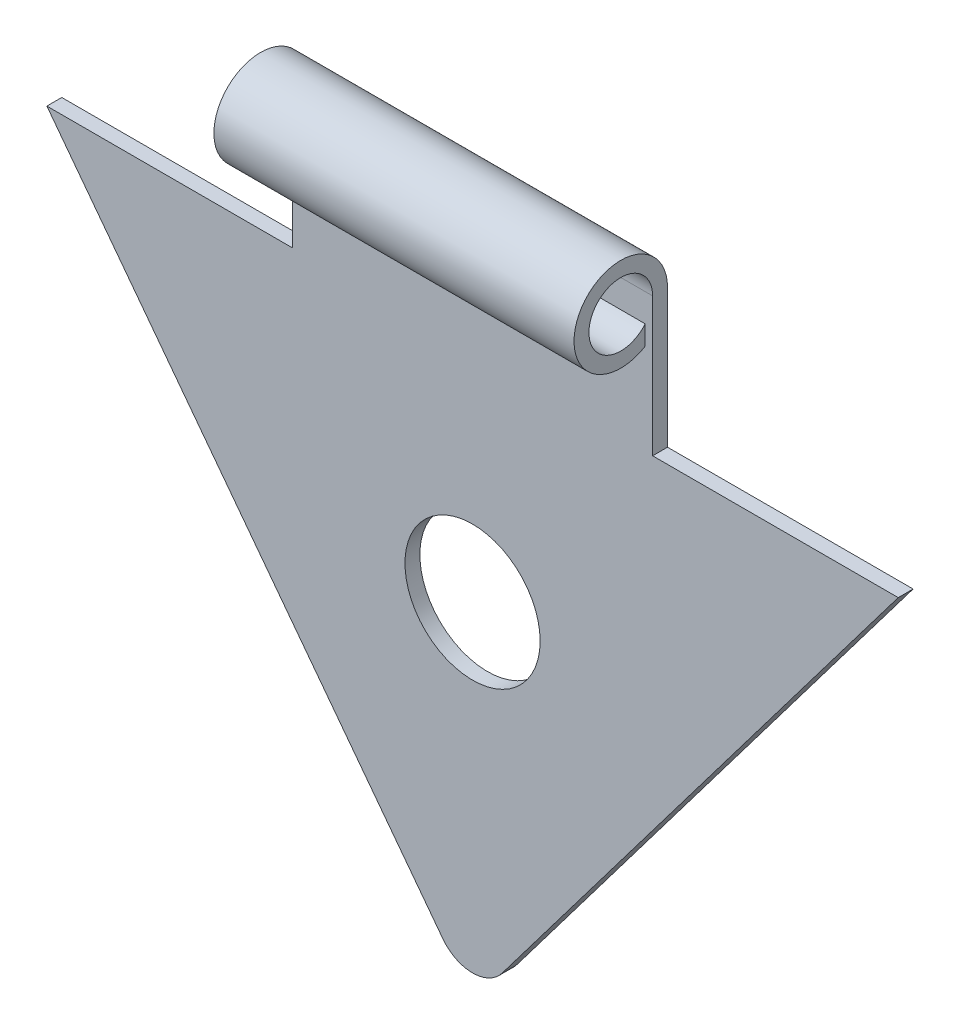
ISO-10303-21;
HEADER;
FILE_DESCRIPTION(('STEP AP214'),'2;1');
FILE_NAME('part.step','',(''),(''),'','','');
FILE_SCHEMA(('AUTOMOTIVE_DESIGN { 1 0 10303 214 1 1 1 1 }'));
ENDSEC;
DATA;
#1=APPLICATION_CONTEXT('core data for automotive mechanical design processes');
#2=APPLICATION_PROTOCOL_DEFINITION('international standard','automotive_design',2000,#1);
#3=PRODUCT_CONTEXT('',#1,'mechanical');
#4=PRODUCT('Part','Part','',(#3));
#5=PRODUCT_RELATED_PRODUCT_CATEGORY('part','',(#4));
#6=PRODUCT_DEFINITION_FORMATION('','',#4);
#7=PRODUCT_DEFINITION_CONTEXT('part definition',#1,'design');
#8=PRODUCT_DEFINITION('design','',#6,#7);
#9=PRODUCT_DEFINITION_SHAPE('','',#8);
#10=(LENGTH_UNIT() NAMED_UNIT(*) SI_UNIT(.MILLI.,.METRE.));
#11=(NAMED_UNIT(*) PLANE_ANGLE_UNIT() SI_UNIT($,.RADIAN.));
#12=(NAMED_UNIT(*) SI_UNIT($,.STERADIAN.) SOLID_ANGLE_UNIT());
#13=UNCERTAINTY_MEASURE_WITH_UNIT(LENGTH_MEASURE(1.E-05),#10,'distance_accuracy_value','');
#14=(GEOMETRIC_REPRESENTATION_CONTEXT(3) GLOBAL_UNCERTAINTY_ASSIGNED_CONTEXT((#13)) GLOBAL_UNIT_ASSIGNED_CONTEXT((#10,
#11,#12)) REPRESENTATION_CONTEXT('',''));
#15=CARTESIAN_POINT('',(0.,0.,0.));
#16=DIRECTION('',(0.,0.,1.));
#17=DIRECTION('',(1.,0.,0.));
#18=AXIS2_PLACEMENT_3D('',#15,#16,#17);
#19=CARTESIAN_POINT('',(-11.43,0.,0.4));
#20=DIRECTION('',(0.,-1.,0.));
#21=DIRECTION('',(0.,0.,-1.));
#22=AXIS2_PLACEMENT_3D('',#19,#20,#21);
#23=PLANE('',#22);
#24=DIRECTION('',(0.,0.,-1.));
#25=VECTOR('',#24,1.);
#26=CARTESIAN_POINT('',(4.835,0.,0.4));
#27=LINE('',#26,#25);
#28=CARTESIAN_POINT('',(4.835,0.,0.4));
#29=VERTEX_POINT('',#28);
#30=CARTESIAN_POINT('',(4.835,0.,0.));
#31=VERTEX_POINT('',#30);
#32=EDGE_CURVE('E135',#29,#31,#27,.T.);
#33=ORIENTED_EDGE('',*,*,#32,.F.);
#34=DIRECTION('',(-1.,0.,0.));
#35=VECTOR('',#34,1.);
#36=CARTESIAN_POINT('',(-11.43,0.,0.4));
#37=LINE('',#36,#35);
#38=CARTESIAN_POINT('',(11.43,0.,0.4));
#39=VERTEX_POINT('',#38);
#40=EDGE_CURVE('E96',#39,#29,#37,.T.);
#41=ORIENTED_EDGE('',*,*,#40,.F.);
#42=DIRECTION('',(0.,0.,-1.));
#43=VECTOR('',#42,1.);
#44=CARTESIAN_POINT('',(11.43,0.,0.4));
#45=LINE('',#44,#43);
#46=CARTESIAN_POINT('',(11.43,0.,0.));
#47=VERTEX_POINT('',#46);
#48=EDGE_CURVE('E11',#39,#47,#45,.T.);
#49=ORIENTED_EDGE('',*,*,#48,.T.);
#50=DIRECTION('',(-1.,0.,0.));
#51=VECTOR('',#50,1.);
#52=CARTESIAN_POINT('',(-11.43,0.,0.));
#53=LINE('',#52,#51);
#54=EDGE_CURVE('E143',#47,#31,#53,.T.);
#55=ORIENTED_EDGE('',*,*,#54,.T.);
#56=EDGE_LOOP('',(#33,#41,#49,#55));
#57=FACE_BOUND('',#56,.T.);
#58=ADVANCED_FACE('F43',(#57),#23,.F.);
#59=CARTESIAN_POINT('',(0.,-13.4431158100442,0.4));
#60=DIRECTION('',(0.,0.,1.));
#61=DIRECTION('',(1.,0.,0.));
#62=AXIS2_PLACEMENT_3D('',#59,#60,#61);
#63=PLANE('',#62);
#64=DIRECTION('',(0.603542484177288,0.797330840864134,0.));
#65=VECTOR('',#64,1.);
#66=CARTESIAN_POINT('',(0.797330840864142,-14.0466582942215,0.4));
#67=LINE('',#66,#65);
#68=CARTESIAN_POINT('',(0.797330840864142,-14.0466582942215,0.4));
#69=VERTEX_POINT('',#68);
#70=EDGE_CURVE('E150',#69,#39,#67,.T.);
#71=ORIENTED_EDGE('',*,*,#70,.T.);
#72=ORIENTED_EDGE('',*,*,#40,.T.);
#73=DIRECTION('',(0.,-1.,0.));
#74=VECTOR('',#73,1.);
#75=CARTESIAN_POINT('',(4.835,3.71869472622847,0.400000000000001));
#76=LINE('',#75,#74);
#77=CARTESIAN_POINT('',(4.835,3.71869472622847,0.400000000000001));
#78=VERTEX_POINT('',#77);
#79=EDGE_CURVE('E132',#78,#29,#76,.T.);
#80=ORIENTED_EDGE('',*,*,#79,.F.);
#81=DIRECTION('',(1.,0.,0.));
#82=VECTOR('',#81,1.);
#83=CARTESIAN_POINT('',(-4.835,3.71869472622847,0.400000000000001));
#84=LINE('',#83,#82);
#85=CARTESIAN_POINT('',(-4.835,3.71869472622847,0.400000000000001));
#86=VERTEX_POINT('',#85);
#87=EDGE_CURVE('E225',#86,#78,#84,.T.);
#88=ORIENTED_EDGE('',*,*,#87,.F.);
#89=DIRECTION('',(0.,-1.,0.));
#90=VECTOR('',#89,1.);
#91=CARTESIAN_POINT('',(-4.835,3.71869472622847,0.400000000000001));
#92=LINE('',#91,#90);
#93=CARTESIAN_POINT('',(-4.835,0.,0.4));
#94=VERTEX_POINT('',#93);
#95=EDGE_CURVE('E224',#86,#94,#92,.T.);
#96=ORIENTED_EDGE('',*,*,#95,.T.);
#97=CARTESIAN_POINT('',(-11.43,0.,0.4));
#98=VERTEX_POINT('',#97);
#99=EDGE_CURVE('E154',#94,#98,#37,.T.);
#100=ORIENTED_EDGE('',*,*,#99,.T.);
#101=DIRECTION('',(0.603542484177288,-0.797330840864134,0.));
#102=VECTOR('',#101,1.);
#103=CARTESIAN_POINT('',(-11.43,0.,0.4));
#104=LINE('',#103,#102);
#105=CARTESIAN_POINT('',(-0.797330840864138,-14.0466582942215,0.4));
#106=VERTEX_POINT('',#105);
#107=EDGE_CURVE('E153',#98,#106,#104,.T.);
#108=ORIENTED_EDGE('',*,*,#107,.T.);
#109=CARTESIAN_POINT('',(0.,-13.4431158100442,0.4));
#110=DIRECTION('',(0.,0.,1.));
#111=DIRECTION('',(1.,0.,0.));
#112=AXIS2_PLACEMENT_3D('',#109,#110,#111);
#113=CIRCLE('',#112,1.);
#114=EDGE_CURVE('E68',#106,#69,#113,.T.);
#115=ORIENTED_EDGE('',*,*,#114,.T.);
#116=EDGE_LOOP('',(#71,#72,#80,#88,#96,#100,#108,#115));
#117=FACE_BOUND('',#116,.T.);
#118=CARTESIAN_POINT('',(0.,-5.82,0.4));
#119=DIRECTION('',(0.,0.,1.));
#120=DIRECTION('',(1.,0.,0.));
#121=AXIS2_PLACEMENT_3D('',#118,#119,#120);
#122=CIRCLE('',#121,1.815);
#123=CARTESIAN_POINT('',(1.815,-5.82,0.4));
#124=VERTEX_POINT('',#123);
#125=EDGE_CURVE('E170',#124,#124,#122,.T.);
#126=ORIENTED_EDGE('',*,*,#125,.F.);
#127=EDGE_LOOP('',(#126));
#128=FACE_BOUND('',#127,.T.);
#129=ADVANCED_FACE('F147',(#117,#128),#63,.T.);
#130=CARTESIAN_POINT('',(0.,-13.4431158100442,0.));
#131=DIRECTION('',(0.,0.,1.));
#132=DIRECTION('',(1.,0.,0.));
#133=AXIS2_PLACEMENT_3D('',#130,#131,#132);
#134=PLANE('',#133);
#135=DIRECTION('',(0.603542484177288,0.797330840864134,0.));
#136=VECTOR('',#135,1.);
#137=CARTESIAN_POINT('',(0.797330840864142,-14.0466582942215,0.));
#138=LINE('',#137,#136);
#139=CARTESIAN_POINT('',(0.797330840864142,-14.0466582942215,0.));
#140=VERTEX_POINT('',#139);
#141=EDGE_CURVE('E165',#140,#47,#138,.T.);
#142=ORIENTED_EDGE('',*,*,#141,.F.);
#143=CARTESIAN_POINT('',(0.,-13.4431158100442,0.));
#144=DIRECTION('',(0.,0.,1.));
#145=DIRECTION('',(1.,0.,0.));
#146=AXIS2_PLACEMENT_3D('',#143,#144,#145);
#147=CIRCLE('',#146,1.);
#148=CARTESIAN_POINT('',(-0.797330840864138,-14.0466582942215,0.));
#149=VERTEX_POINT('',#148);
#150=EDGE_CURVE('E89',#149,#140,#147,.T.);
#151=ORIENTED_EDGE('',*,*,#150,.F.);
#152=DIRECTION('',(0.603542484177288,-0.797330840864134,0.));
#153=VECTOR('',#152,1.);
#154=CARTESIAN_POINT('',(-11.43,0.,0.));
#155=LINE('',#154,#153);
#156=CARTESIAN_POINT('',(-11.43,0.,0.));
#157=VERTEX_POINT('',#156);
#158=EDGE_CURVE('E173',#157,#149,#155,.T.);
#159=ORIENTED_EDGE('',*,*,#158,.F.);
#160=CARTESIAN_POINT('',(-4.835,0.,0.));
#161=VERTEX_POINT('',#160);
#162=EDGE_CURVE('E169',#161,#157,#53,.T.);
#163=ORIENTED_EDGE('',*,*,#162,.F.);
#164=DIRECTION('',(0.,1.,0.));
#165=VECTOR('',#164,1.);
#166=CARTESIAN_POINT('',(-4.835,3.71869472622847,0.));
#167=LINE('',#166,#165);
#168=CARTESIAN_POINT('',(-4.835,3.71869472622847,0.));
#169=VERTEX_POINT('',#168);
#170=EDGE_CURVE('E59',#161,#169,#167,.T.);
#171=ORIENTED_EDGE('',*,*,#170,.T.);
#172=DIRECTION('',(1.,0.,0.));
#173=VECTOR('',#172,1.);
#174=CARTESIAN_POINT('',(-4.835,3.71869472622847,0.));
#175=LINE('',#174,#173);
#176=CARTESIAN_POINT('',(4.835,3.71869472622847,0.));
#177=VERTEX_POINT('',#176);
#178=EDGE_CURVE('E250',#169,#177,#175,.T.);
#179=ORIENTED_EDGE('',*,*,#178,.T.);
#180=DIRECTION('',(0.,1.,0.));
#181=VECTOR('',#180,1.);
#182=CARTESIAN_POINT('',(4.835,3.71869472622847,0.));
#183=LINE('',#182,#181);
#184=EDGE_CURVE('E145',#31,#177,#183,.T.);
#185=ORIENTED_EDGE('',*,*,#184,.F.);
#186=ORIENTED_EDGE('',*,*,#54,.F.);
#187=EDGE_LOOP('',(#142,#151,#159,#163,#171,#179,#185,#186));
#188=FACE_BOUND('',#187,.T.);
#189=CARTESIAN_POINT('',(0.,-5.82,0.));
#190=DIRECTION('',(0.,0.,1.));
#191=DIRECTION('',(1.,0.,0.));
#192=AXIS2_PLACEMENT_3D('',#189,#190,#191);
#193=CIRCLE('',#192,1.815);
#194=CARTESIAN_POINT('',(1.815,-5.82,0.));
#195=VERTEX_POINT('',#194);
#196=EDGE_CURVE('E253',#195,#195,#193,.T.);
#197=ORIENTED_EDGE('',*,*,#196,.T.);
#198=EDGE_LOOP('',(#197));
#199=FACE_BOUND('',#198,.T.);
#200=ADVANCED_FACE('F195',(#188,#199),#134,.F.);
#201=CARTESIAN_POINT('',(0.797330840864142,-14.0466582942215,0.4));
#202=DIRECTION('',(-0.797330840864134,0.603542484177288,0.));
#203=DIRECTION('',(-0.603542484177288,-0.797330840864134,0.));
#204=AXIS2_PLACEMENT_3D('',#201,#202,#203);
#205=PLANE('',#204);
#206=ORIENTED_EDGE('',*,*,#141,.T.);
#207=ORIENTED_EDGE('',*,*,#48,.F.);
#208=ORIENTED_EDGE('',*,*,#70,.F.);
#209=DIRECTION('',(0.,0.,-1.));
#210=VECTOR('',#209,1.);
#211=CARTESIAN_POINT('',(0.797330840864142,-14.0466582942215,0.4));
#212=LINE('',#211,#210);
#213=EDGE_CURVE('E164',#69,#140,#212,.T.);
#214=ORIENTED_EDGE('',*,*,#213,.T.);
#215=EDGE_LOOP('',(#206,#207,#208,#214));
#216=FACE_BOUND('',#215,.T.);
#217=ADVANCED_FACE('F45',(#216),#205,.F.);
#218=ORIENTED_EDGE('',*,*,#99,.F.);
#219=DIRECTION('',(0.,0.,-1.));
#220=VECTOR('',#219,1.);
#221=CARTESIAN_POINT('',(-4.835,0.,0.4));
#222=LINE('',#221,#220);
#223=EDGE_CURVE('E221',#94,#161,#222,.T.);
#224=ORIENTED_EDGE('',*,*,#223,.T.);
#225=ORIENTED_EDGE('',*,*,#162,.T.);
#226=DIRECTION('',(0.,0.,-1.));
#227=VECTOR('',#226,1.);
#228=CARTESIAN_POINT('',(-11.43,0.,0.4));
#229=LINE('',#228,#227);
#230=EDGE_CURVE('E52',#98,#157,#229,.T.);
#231=ORIENTED_EDGE('',*,*,#230,.F.);
#232=EDGE_LOOP('',(#218,#224,#225,#231));
#233=FACE_BOUND('',#232,.T.);
#234=ADVANCED_FACE('F209',(#233),#23,.F.);
#235=CARTESIAN_POINT('',(-11.43,0.,0.4));
#236=DIRECTION('',(0.797330840864134,0.603542484177288,0.));
#237=DIRECTION('',(-0.603542484177289,0.797330840864135,0.));
#238=AXIS2_PLACEMENT_3D('',#235,#236,#237);
#239=PLANE('',#238);
#240=ORIENTED_EDGE('',*,*,#158,.T.);
#241=DIRECTION('',(0.,0.,-1.));
#242=VECTOR('',#241,1.);
#243=CARTESIAN_POINT('',(-0.797330840864138,-14.0466582942215,0.4));
#244=LINE('',#243,#242);
#245=EDGE_CURVE('E180',#106,#149,#244,.T.);
#246=ORIENTED_EDGE('',*,*,#245,.F.);
#247=ORIENTED_EDGE('',*,*,#107,.F.);
#248=ORIENTED_EDGE('',*,*,#230,.T.);
#249=EDGE_LOOP('',(#240,#246,#247,#248));
#250=FACE_BOUND('',#249,.T.);
#251=ADVANCED_FACE('F188',(#250),#239,.F.);
#252=CARTESIAN_POINT('',(0.,-13.4431158100442,0.4));
#253=DIRECTION('',(0.,0.,-1.));
#254=DIRECTION('',(-1.,0.,0.));
#255=AXIS2_PLACEMENT_3D('',#252,#253,#254);
#256=CYLINDRICAL_SURFACE('',#255,1.);
#257=ORIENTED_EDGE('',*,*,#150,.T.);
#258=ORIENTED_EDGE('',*,*,#213,.F.);
#259=ORIENTED_EDGE('',*,*,#114,.F.);
#260=ORIENTED_EDGE('',*,*,#245,.T.);
#261=EDGE_LOOP('',(#257,#258,#259,#260));
#262=FACE_BOUND('',#261,.T.);
#263=ADVANCED_FACE('F198',(#262),#256,.T.);
#264=CARTESIAN_POINT('',(0.,-5.82,0.4));
#265=DIRECTION('',(0.,0.,-1.));
#266=DIRECTION('',(-1.,0.,0.));
#267=AXIS2_PLACEMENT_3D('',#264,#265,#266);
#268=CYLINDRICAL_SURFACE('',#267,1.815);
#269=ORIENTED_EDGE('',*,*,#125,.T.);
#270=EDGE_LOOP('',(#269));
#271=FACE_BOUND('',#270,.T.);
#272=ORIENTED_EDGE('',*,*,#196,.F.);
#273=EDGE_LOOP('',(#272));
#274=FACE_BOUND('',#273,.T.);
#275=ADVANCED_FACE('F200',(#271,#274),#268,.F.);
#276=CARTESIAN_POINT('',(-4.835,3.71869472622847,1.255));
#277=DIRECTION('',(1.,0.,0.));
#278=DIRECTION('',(0.,0.,-1.));
#279=AXIS2_PLACEMENT_3D('',#276,#277,#278);
#280=CYLINDRICAL_SURFACE('',#279,0.855);
#281=ORIENTED_EDGE('',*,*,#87,.T.);
#282=CARTESIAN_POINT('',(4.835,3.71869472622847,1.255));
#283=DIRECTION('',(-1.,0.,0.));
#284=DIRECTION('',(0.,0.,-1.));
#285=AXIS2_PLACEMENT_3D('',#282,#283,#284);
#286=CIRCLE('',#285,0.855);
#287=CARTESIAN_POINT('',(4.835,3.16914945966711,0.600000000000001));
#288=VERTEX_POINT('',#287);
#289=EDGE_CURVE('E139',#288,#78,#286,.T.);
#290=ORIENTED_EDGE('',*,*,#289,.F.);
#291=DIRECTION('',(1.,0.,0.));
#292=VECTOR('',#291,1.);
#293=CARTESIAN_POINT('',(-4.835,3.16914945966711,0.600000000000001));
#294=LINE('',#293,#292);
#295=CARTESIAN_POINT('',(-4.835,3.16914945966711,0.600000000000001));
#296=VERTEX_POINT('',#295);
#297=EDGE_CURVE('E254',#296,#288,#294,.T.);
#298=ORIENTED_EDGE('',*,*,#297,.F.);
#299=CARTESIAN_POINT('',(-4.835,3.71869472622847,1.255));
#300=DIRECTION('',(-1.,0.,0.));
#301=DIRECTION('',(0.,0.,-1.));
#302=AXIS2_PLACEMENT_3D('',#299,#300,#301);
#303=CIRCLE('',#302,0.855);
#304=EDGE_CURVE('E247',#296,#86,#303,.T.);
#305=ORIENTED_EDGE('',*,*,#304,.T.);
#306=EDGE_LOOP('',(#281,#290,#298,#305));
#307=FACE_BOUND('',#306,.T.);
#308=ADVANCED_FACE('F206',(#307),#280,.F.);
#309=CARTESIAN_POINT('',(-4.835,2.64818083094266,0.600000000000001));
#310=DIRECTION('',(0.,0.,-1.));
#311=DIRECTION('',(0.,1.,0.));
#312=AXIS2_PLACEMENT_3D('',#309,#310,#311);
#313=PLANE('',#312);
#314=ORIENTED_EDGE('',*,*,#297,.T.);
#315=DIRECTION('',(0.,1.,0.));
#316=VECTOR('',#315,1.);
#317=CARTESIAN_POINT('',(4.835,2.64818083094266,0.600000000000001));
#318=LINE('',#317,#316);
#319=CARTESIAN_POINT('',(4.835,2.64818083094266,0.600000000000001));
#320=VERTEX_POINT('',#319);
#321=EDGE_CURVE('E233',#320,#288,#318,.T.);
#322=ORIENTED_EDGE('',*,*,#321,.F.);
#323=DIRECTION('',(1.,0.,0.));
#324=VECTOR('',#323,1.);
#325=CARTESIAN_POINT('',(-4.835,2.64818083094266,0.600000000000001));
#326=LINE('',#325,#324);
#327=CARTESIAN_POINT('',(-4.835,2.64818083094266,0.600000000000001));
#328=VERTEX_POINT('',#327);
#329=EDGE_CURVE('E257',#328,#320,#326,.T.);
#330=ORIENTED_EDGE('',*,*,#329,.F.);
#331=DIRECTION('',(0.,1.,0.));
#332=VECTOR('',#331,1.);
#333=CARTESIAN_POINT('',(-4.835,2.64818083094266,0.600000000000001));
#334=LINE('',#333,#332);
#335=EDGE_CURVE('E243',#328,#296,#334,.T.);
#336=ORIENTED_EDGE('',*,*,#335,.T.);
#337=EDGE_LOOP('',(#314,#322,#330,#336));
#338=FACE_BOUND('',#337,.T.);
#339=ADVANCED_FACE('F276',(#338),#313,.T.);
#340=CARTESIAN_POINT('',(-4.835,3.71869472622847,1.255));
#341=DIRECTION('',(1.,0.,0.));
#342=DIRECTION('',(0.,0.,-1.));
#343=AXIS2_PLACEMENT_3D('',#340,#341,#342);
#344=CYLINDRICAL_SURFACE('',#343,1.255);
#345=ORIENTED_EDGE('',*,*,#329,.T.);
#346=CARTESIAN_POINT('',(4.835,3.71869472622847,1.255));
#347=DIRECTION('',(1.,0.,0.));
#348=DIRECTION('',(0.,0.,-1.));
#349=AXIS2_PLACEMENT_3D('',#346,#347,#348);
#350=CIRCLE('',#349,1.255);
#351=EDGE_CURVE('E392',#177,#320,#350,.T.);
#352=ORIENTED_EDGE('',*,*,#351,.F.);
#353=ORIENTED_EDGE('',*,*,#178,.F.);
#354=CARTESIAN_POINT('',(-4.835,3.71869472622847,1.255));
#355=DIRECTION('',(1.,0.,0.));
#356=DIRECTION('',(0.,0.,-1.));
#357=AXIS2_PLACEMENT_3D('',#354,#355,#356);
#358=CIRCLE('',#357,1.255);
#359=EDGE_CURVE('E239',#169,#328,#358,.T.);
#360=ORIENTED_EDGE('',*,*,#359,.T.);
#361=EDGE_LOOP('',(#345,#352,#353,#360));
#362=FACE_BOUND('',#361,.T.);
#363=ADVANCED_FACE('F272',(#362),#344,.T.);
#364=CARTESIAN_POINT('',(-4.835,3.71869472622847,1.255));
#365=DIRECTION('',(1.,0.,0.));
#366=DIRECTION('',(0.,0.,-1.));
#367=AXIS2_PLACEMENT_3D('',#364,#365,#366);
#368=PLANE('',#367);
#369=ORIENTED_EDGE('',*,*,#95,.F.);
#370=ORIENTED_EDGE('',*,*,#304,.F.);
#371=ORIENTED_EDGE('',*,*,#335,.F.);
#372=ORIENTED_EDGE('',*,*,#359,.F.);
#373=ORIENTED_EDGE('',*,*,#170,.F.);
#374=ORIENTED_EDGE('',*,*,#223,.F.);
#375=EDGE_LOOP('',(#369,#370,#371,#372,#373,#374));
#376=FACE_BOUND('',#375,.T.);
#377=ADVANCED_FACE('F275',(#376),#368,.F.);
#378=CARTESIAN_POINT('',(4.835,3.71869472622847,1.255));
#379=DIRECTION('',(1.,0.,0.));
#380=DIRECTION('',(0.,0.,-1.));
#381=AXIS2_PLACEMENT_3D('',#378,#379,#380);
#382=PLANE('',#381);
#383=ORIENTED_EDGE('',*,*,#79,.T.);
#384=ORIENTED_EDGE('',*,*,#32,.T.);
#385=ORIENTED_EDGE('',*,*,#184,.T.);
#386=ORIENTED_EDGE('',*,*,#351,.T.);
#387=ORIENTED_EDGE('',*,*,#321,.T.);
#388=ORIENTED_EDGE('',*,*,#289,.T.);
#389=EDGE_LOOP('',(#383,#384,#385,#386,#387,#388));
#390=FACE_BOUND('',#389,.T.);
#391=ADVANCED_FACE('F133',(#390),#382,.T.);
#392=CLOSED_SHELL('',(#58,#129,#200,#217,#234,#251,#263,#275,#308,#339,#363,#377,#391));
#393=MANIFOLD_SOLID_BREP('B2',#392);
#394=ADVANCED_BREP_SHAPE_REPRESENTATION('',(#18,#393),#14);
#395=SHAPE_DEFINITION_REPRESENTATION(#9,#394);
ENDSEC;
END-ISO-10303-21;
